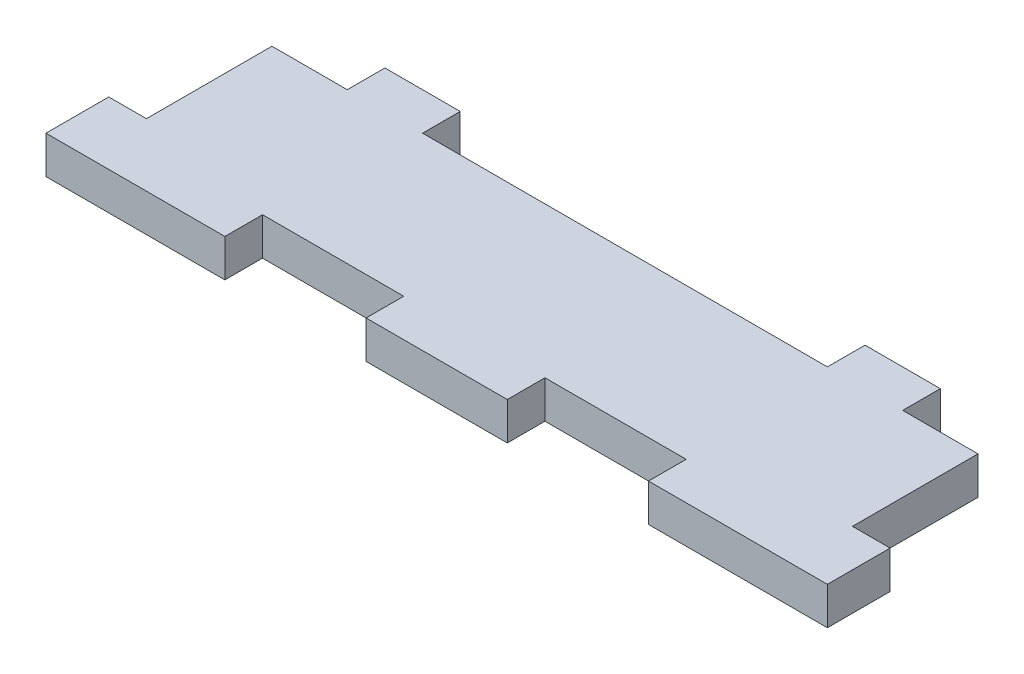
ISO-10303-21;
HEADER;
FILE_DESCRIPTION(('STEP AP214'),'2;1');
FILE_NAME('part.step','',(''),(''),'','','');
FILE_SCHEMA(('AUTOMOTIVE_DESIGN { 1 0 10303 214 1 1 1 1 }'));
ENDSEC;
DATA;
#1=APPLICATION_CONTEXT('core data for automotive mechanical design processes');
#2=APPLICATION_PROTOCOL_DEFINITION('international standard','automotive_design',2000,#1);
#3=PRODUCT_CONTEXT('',#1,'mechanical');
#4=PRODUCT('Part','Part','',(#3));
#5=PRODUCT_RELATED_PRODUCT_CATEGORY('part','',(#4));
#6=PRODUCT_DEFINITION_FORMATION('','',#4);
#7=PRODUCT_DEFINITION_CONTEXT('part definition',#1,'design');
#8=PRODUCT_DEFINITION('design','',#6,#7);
#9=PRODUCT_DEFINITION_SHAPE('','',#8);
#10=(LENGTH_UNIT() NAMED_UNIT(*) SI_UNIT(.MILLI.,.METRE.));
#11=(NAMED_UNIT(*) PLANE_ANGLE_UNIT() SI_UNIT($,.RADIAN.));
#12=(NAMED_UNIT(*) SI_UNIT($,.STERADIAN.) SOLID_ANGLE_UNIT());
#13=UNCERTAINTY_MEASURE_WITH_UNIT(LENGTH_MEASURE(1.E-05),#10,'distance_accuracy_value','');
#14=(GEOMETRIC_REPRESENTATION_CONTEXT(3) GLOBAL_UNCERTAINTY_ASSIGNED_CONTEXT((#13)) GLOBAL_UNIT_ASSIGNED_CONTEXT((#10,
#11,#12)) REPRESENTATION_CONTEXT('',''));
#15=CARTESIAN_POINT('',(0.,0.,0.));
#16=DIRECTION('',(0.,0.,1.));
#17=DIRECTION('',(1.,0.,0.));
#18=AXIS2_PLACEMENT_3D('',#15,#16,#17);
#19=CARTESIAN_POINT('',(-56.25,6.,-12.));
#20=DIRECTION('',(0.,0.,1.));
#21=DIRECTION('',(1.,0.,0.));
#22=AXIS2_PLACEMENT_3D('',#19,#20,#21);
#23=PLANE('',#22);
#24=DIRECTION('',(0.,1.,0.));
#25=VECTOR('',#24,1.);
#26=CARTESIAN_POINT('',(-44.25,0.,-12.));
#27=LINE('',#26,#25);
#28=CARTESIAN_POINT('',(-44.25,0.,-12.));
#29=VERTEX_POINT('',#28);
#30=CARTESIAN_POINT('',(-44.25,6.,-12.));
#31=VERTEX_POINT('',#30);
#32=EDGE_CURVE('E399',#29,#31,#27,.T.);
#33=ORIENTED_EDGE('',*,*,#32,.F.);
#34=DIRECTION('',(-1.,0.,0.));
#35=VECTOR('',#34,1.);
#36=CARTESIAN_POINT('',(-56.25,0.,-12.));
#37=LINE('',#36,#35);
#38=CARTESIAN_POINT('',(-56.25,0.,-12.));
#39=VERTEX_POINT('',#38);
#40=EDGE_CURVE('E226',#29,#39,#37,.T.);
#41=ORIENTED_EDGE('',*,*,#40,.T.);
#42=DIRECTION('',(0.,-1.,0.));
#43=VECTOR('',#42,1.);
#44=CARTESIAN_POINT('',(-56.25,6.,-12.));
#45=LINE('',#44,#43);
#46=CARTESIAN_POINT('',(-56.25,6.,-12.));
#47=VERTEX_POINT('',#46);
#48=EDGE_CURVE('E49',#47,#39,#45,.T.);
#49=ORIENTED_EDGE('',*,*,#48,.F.);
#50=DIRECTION('',(-1.,0.,0.));
#51=VECTOR('',#50,1.);
#52=CARTESIAN_POINT('',(-56.25,6.,-12.));
#53=LINE('',#52,#51);
#54=EDGE_CURVE('E56',#31,#47,#53,.T.);
#55=ORIENTED_EDGE('',*,*,#54,.F.);
#56=EDGE_LOOP('',(#33,#41,#49,#55));
#57=FACE_BOUND('',#56,.T.);
#58=ADVANCED_FACE('F41',(#57),#23,.F.);
#59=CARTESIAN_POINT('',(32.25,0.,-12.));
#60=VERTEX_POINT('',#59);
#61=CARTESIAN_POINT('',(-32.25,0.,-12.));
#62=VERTEX_POINT('',#61);
#63=EDGE_CURVE('E373',#60,#62,#37,.T.);
#64=ORIENTED_EDGE('',*,*,#63,.T.);
#65=DIRECTION('',(0.,1.,0.));
#66=VECTOR('',#65,1.);
#67=CARTESIAN_POINT('',(-32.25,0.,-12.));
#68=LINE('',#67,#66);
#69=CARTESIAN_POINT('',(-32.25,6.,-12.));
#70=VERTEX_POINT('',#69);
#71=EDGE_CURVE('E64',#62,#70,#68,.T.);
#72=ORIENTED_EDGE('',*,*,#71,.T.);
#73=CARTESIAN_POINT('',(32.25,6.,-12.));
#74=VERTEX_POINT('',#73);
#75=EDGE_CURVE('E362',#74,#70,#53,.T.);
#76=ORIENTED_EDGE('',*,*,#75,.F.);
#77=DIRECTION('',(0.,1.,0.));
#78=VECTOR('',#77,1.);
#79=CARTESIAN_POINT('',(32.25,0.,-12.));
#80=LINE('',#79,#78);
#81=EDGE_CURVE('E229',#60,#74,#80,.T.);
#82=ORIENTED_EDGE('',*,*,#81,.F.);
#83=EDGE_LOOP('',(#64,#72,#76,#82));
#84=FACE_BOUND('',#83,.T.);
#85=ADVANCED_FACE('F403',(#84),#23,.F.);
#86=CARTESIAN_POINT('',(56.25,6.,12.));
#87=DIRECTION('',(-1.,0.,0.));
#88=DIRECTION('',(0.,0.,1.));
#89=AXIS2_PLACEMENT_3D('',#86,#87,#88);
#90=PLANE('',#89);
#91=DIRECTION('',(0.,1.,0.));
#92=VECTOR('',#91,1.);
#93=CARTESIAN_POINT('',(56.25,0.,8.));
#94=LINE('',#93,#92);
#95=CARTESIAN_POINT('',(56.25,0.,8.));
#96=VERTEX_POINT('',#95);
#97=CARTESIAN_POINT('',(56.25,6.00000000000007,8.));
#98=VERTEX_POINT('',#97);
#99=EDGE_CURVE('E277',#96,#98,#94,.T.);
#100=ORIENTED_EDGE('',*,*,#99,.F.);
#101=DIRECTION('',(0.,0.,-1.));
#102=VECTOR('',#101,1.);
#103=CARTESIAN_POINT('',(56.25,0.,12.));
#104=LINE('',#103,#102);
#105=CARTESIAN_POINT('',(56.25,0.,-12.));
#106=VERTEX_POINT('',#105);
#107=EDGE_CURVE('E354',#96,#106,#104,.T.);
#108=ORIENTED_EDGE('',*,*,#107,.T.);
#109=DIRECTION('',(0.,-1.,0.));
#110=VECTOR('',#109,1.);
#111=CARTESIAN_POINT('',(56.25,6.,-12.));
#112=LINE('',#111,#110);
#113=CARTESIAN_POINT('',(56.25,6.,-12.));
#114=VERTEX_POINT('',#113);
#115=EDGE_CURVE('E11',#114,#106,#112,.T.);
#116=ORIENTED_EDGE('',*,*,#115,.F.);
#117=DIRECTION('',(0.,0.,-1.));
#118=VECTOR('',#117,1.);
#119=CARTESIAN_POINT('',(56.25,6.,12.));
#120=LINE('',#119,#118);
#121=EDGE_CURVE('E355',#98,#114,#120,.T.);
#122=ORIENTED_EDGE('',*,*,#121,.F.);
#123=EDGE_LOOP('',(#100,#108,#116,#122));
#124=FACE_BOUND('',#123,.T.);
#125=ADVANCED_FACE('F43',(#124),#90,.F.);
#126=CARTESIAN_POINT('',(-56.25,6.,12.));
#127=DIRECTION('',(0.,0.,-1.));
#128=DIRECTION('',(-1.,0.,0.));
#129=AXIS2_PLACEMENT_3D('',#126,#127,#128);
#130=PLANE('',#129);
#131=DIRECTION('',(0.,-1.,0.));
#132=VECTOR('',#131,1.);
#133=CARTESIAN_POINT('',(33.75,0.,12.));
#134=LINE('',#133,#132);
#135=CARTESIAN_POINT('',(33.75,6.,12.));
#136=VERTEX_POINT('',#135);
#137=CARTESIAN_POINT('',(33.75,0.,12.));
#138=VERTEX_POINT('',#137);
#139=EDGE_CURVE('E296',#136,#138,#134,.T.);
#140=ORIENTED_EDGE('',*,*,#139,.F.);
#141=DIRECTION('',(1.,0.,0.));
#142=VECTOR('',#141,1.);
#143=CARTESIAN_POINT('',(-56.25,6.,12.));
#144=LINE('',#143,#142);
#145=CARTESIAN_POINT('',(11.25,6.,12.));
#146=VERTEX_POINT('',#145);
#147=EDGE_CURVE('E365',#146,#136,#144,.T.);
#148=ORIENTED_EDGE('',*,*,#147,.F.);
#149=DIRECTION('',(0.,1.,0.));
#150=VECTOR('',#149,1.);
#151=CARTESIAN_POINT('',(11.25,0.,12.));
#152=LINE('',#151,#150);
#153=CARTESIAN_POINT('',(11.25,0.,12.));
#154=VERTEX_POINT('',#153);
#155=EDGE_CURVE('E317',#154,#146,#152,.T.);
#156=ORIENTED_EDGE('',*,*,#155,.F.);
#157=DIRECTION('',(1.,0.,0.));
#158=VECTOR('',#157,1.);
#159=CARTESIAN_POINT('',(-56.25,0.,12.));
#160=LINE('',#159,#158);
#161=EDGE_CURVE('E376',#154,#138,#160,.T.);
#162=ORIENTED_EDGE('',*,*,#161,.T.);
#163=EDGE_LOOP('',(#140,#148,#156,#162));
#164=FACE_BOUND('',#163,.T.);
#165=ADVANCED_FACE('F443',(#164),#130,.F.);
#166=DIRECTION('',(0.,-1.,0.));
#167=VECTOR('',#166,1.);
#168=CARTESIAN_POINT('',(-11.25,0.,12.));
#169=LINE('',#168,#167);
#170=CARTESIAN_POINT('',(-11.25,6.,12.));
#171=VERTEX_POINT('',#170);
#172=CARTESIAN_POINT('',(-11.25,0.,12.));
#173=VERTEX_POINT('',#172);
#174=EDGE_CURVE('E312',#171,#173,#169,.T.);
#175=ORIENTED_EDGE('',*,*,#174,.F.);
#176=CARTESIAN_POINT('',(-33.75,6.,12.));
#177=VERTEX_POINT('',#176);
#178=EDGE_CURVE('E366',#177,#171,#144,.T.);
#179=ORIENTED_EDGE('',*,*,#178,.F.);
#180=DIRECTION('',(0.,1.,0.));
#181=VECTOR('',#180,1.);
#182=CARTESIAN_POINT('',(-33.75,0.,12.));
#183=LINE('',#182,#181);
#184=CARTESIAN_POINT('',(-33.75,0.,12.));
#185=VERTEX_POINT('',#184);
#186=EDGE_CURVE('E339',#185,#177,#183,.T.);
#187=ORIENTED_EDGE('',*,*,#186,.F.);
#188=EDGE_CURVE('E357',#185,#173,#160,.T.);
#189=ORIENTED_EDGE('',*,*,#188,.T.);
#190=EDGE_LOOP('',(#175,#179,#187,#189));
#191=FACE_BOUND('',#190,.T.);
#192=ADVANCED_FACE('F459',(#191),#130,.F.);
#193=CARTESIAN_POINT('',(44.25,0.,-12.));
#194=VERTEX_POINT('',#193);
#195=EDGE_CURVE('E370',#106,#194,#37,.T.);
#196=ORIENTED_EDGE('',*,*,#195,.T.);
#197=DIRECTION('',(0.,1.,0.));
#198=VECTOR('',#197,1.);
#199=CARTESIAN_POINT('',(44.25,0.,-12.));
#200=LINE('',#199,#198);
#201=CARTESIAN_POINT('',(44.25,6.,-12.));
#202=VERTEX_POINT('',#201);
#203=EDGE_CURVE('E227',#194,#202,#200,.T.);
#204=ORIENTED_EDGE('',*,*,#203,.T.);
#205=EDGE_CURVE('E358',#114,#202,#53,.T.);
#206=ORIENTED_EDGE('',*,*,#205,.F.);
#207=ORIENTED_EDGE('',*,*,#115,.T.);
#208=EDGE_LOOP('',(#196,#204,#206,#207));
#209=FACE_BOUND('',#208,.T.);
#210=ADVANCED_FACE('F419',(#209),#23,.F.);
#211=CARTESIAN_POINT('',(-56.25,6.,12.));
#212=DIRECTION('',(1.,0.,0.));
#213=DIRECTION('',(0.,0.,-1.));
#214=AXIS2_PLACEMENT_3D('',#211,#212,#213);
#215=PLANE('',#214);
#216=DIRECTION('',(0.,0.,1.));
#217=VECTOR('',#216,1.);
#218=CARTESIAN_POINT('',(-56.25,0.,12.));
#219=LINE('',#218,#217);
#220=CARTESIAN_POINT('',(-56.25,0.,8.));
#221=VERTEX_POINT('',#220);
#222=EDGE_CURVE('E372',#39,#221,#219,.T.);
#223=ORIENTED_EDGE('',*,*,#222,.T.);
#224=DIRECTION('',(0.,1.,0.));
#225=VECTOR('',#224,1.);
#226=CARTESIAN_POINT('',(-56.25,0.,8.));
#227=LINE('',#226,#225);
#228=CARTESIAN_POINT('',(-56.25,6.,8.));
#229=VERTEX_POINT('',#228);
#230=EDGE_CURVE('E258',#221,#229,#227,.T.);
#231=ORIENTED_EDGE('',*,*,#230,.T.);
#232=DIRECTION('',(0.,0.,1.));
#233=VECTOR('',#232,1.);
#234=CARTESIAN_POINT('',(-56.25,6.,12.));
#235=LINE('',#234,#233);
#236=EDGE_CURVE('E361',#47,#229,#235,.T.);
#237=ORIENTED_EDGE('',*,*,#236,.F.);
#238=ORIENTED_EDGE('',*,*,#48,.T.);
#239=EDGE_LOOP('',(#223,#231,#237,#238));
#240=FACE_BOUND('',#239,.T.);
#241=ADVANCED_FACE('F380',(#240),#215,.F.);
#242=CARTESIAN_POINT('',(0.,6.,0.));
#243=DIRECTION('',(0.,-1.,0.));
#244=DIRECTION('',(0.,0.,-1.));
#245=AXIS2_PLACEMENT_3D('',#242,#243,#244);
#246=PLANE('',#245);
#247=DIRECTION('',(-1.,0.,0.));
#248=VECTOR('',#247,1.);
#249=CARTESIAN_POINT('',(33.75,6.,18.));
#250=LINE('',#249,#248);
#251=CARTESIAN_POINT('',(62.25,6.00000000000007,18.));
#252=VERTEX_POINT('',#251);
#253=CARTESIAN_POINT('',(33.75,6.,18.));
#254=VERTEX_POINT('',#253);
#255=EDGE_CURVE('E302',#252,#254,#250,.T.);
#256=ORIENTED_EDGE('',*,*,#255,.F.);
#257=DIRECTION('',(0.,0.,1.));
#258=VECTOR('',#257,1.);
#259=CARTESIAN_POINT('',(62.25,6.00000000000007,18.));
#260=LINE('',#259,#258);
#261=CARTESIAN_POINT('',(62.25,6.00000000000007,8.));
#262=VERTEX_POINT('',#261);
#263=EDGE_CURVE('E285',#262,#252,#260,.T.);
#264=ORIENTED_EDGE('',*,*,#263,.F.);
#265=DIRECTION('',(-1.,0.,0.));
#266=VECTOR('',#265,1.);
#267=CARTESIAN_POINT('',(62.25,6.00000000000007,8.));
#268=LINE('',#267,#266);
#269=EDGE_CURVE('E288',#262,#98,#268,.T.);
#270=ORIENTED_EDGE('',*,*,#269,.T.);
#271=ORIENTED_EDGE('',*,*,#121,.T.);
#272=ORIENTED_EDGE('',*,*,#205,.T.);
#273=DIRECTION('',(0.,0.,1.));
#274=VECTOR('',#273,1.);
#275=CARTESIAN_POINT('',(44.25,6.,-18.));
#276=LINE('',#275,#274);
#277=CARTESIAN_POINT('',(44.25,6.,-18.));
#278=VERTEX_POINT('',#277);
#279=EDGE_CURVE('E243',#278,#202,#276,.T.);
#280=ORIENTED_EDGE('',*,*,#279,.F.);
#281=DIRECTION('',(1.,0.,0.));
#282=VECTOR('',#281,1.);
#283=CARTESIAN_POINT('',(0.,6.,-18.));
#284=LINE('',#283,#282);
#285=CARTESIAN_POINT('',(32.25,6.,-18.));
#286=VERTEX_POINT('',#285);
#287=EDGE_CURVE('E242',#286,#278,#284,.T.);
#288=ORIENTED_EDGE('',*,*,#287,.F.);
#289=DIRECTION('',(0.,0.,1.));
#290=VECTOR('',#289,1.);
#291=CARTESIAN_POINT('',(32.25,6.,-18.));
#292=LINE('',#291,#290);
#293=EDGE_CURVE('E249',#286,#74,#292,.T.);
#294=ORIENTED_EDGE('',*,*,#293,.T.);
#295=ORIENTED_EDGE('',*,*,#75,.T.);
#296=DIRECTION('',(0.,0.,1.));
#297=VECTOR('',#296,1.);
#298=CARTESIAN_POINT('',(-32.25,6.,-18.));
#299=LINE('',#298,#297);
#300=CARTESIAN_POINT('',(-32.25,6.,-18.));
#301=VERTEX_POINT('',#300);
#302=EDGE_CURVE('E231',#301,#70,#299,.T.);
#303=ORIENTED_EDGE('',*,*,#302,.F.);
#304=DIRECTION('',(1.,0.,0.));
#305=VECTOR('',#304,1.);
#306=CARTESIAN_POINT('',(0.,6.,-18.));
#307=LINE('',#306,#305);
#308=CARTESIAN_POINT('',(-44.25,6.,-18.));
#309=VERTEX_POINT('',#308);
#310=EDGE_CURVE('E212',#309,#301,#307,.T.);
#311=ORIENTED_EDGE('',*,*,#310,.F.);
#312=DIRECTION('',(0.,0.,1.));
#313=VECTOR('',#312,1.);
#314=CARTESIAN_POINT('',(-44.25,6.,-18.));
#315=LINE('',#314,#313);
#316=EDGE_CURVE('E209',#309,#31,#315,.T.);
#317=ORIENTED_EDGE('',*,*,#316,.T.);
#318=ORIENTED_EDGE('',*,*,#54,.T.);
#319=ORIENTED_EDGE('',*,*,#236,.T.);
#320=DIRECTION('',(1.,0.,0.));
#321=VECTOR('',#320,1.);
#322=CARTESIAN_POINT('',(-62.25,6.00000000000007,8.));
#323=LINE('',#322,#321);
#324=CARTESIAN_POINT('',(-62.25,6.00000000000007,8.));
#325=VERTEX_POINT('',#324);
#326=EDGE_CURVE('E275',#325,#229,#323,.T.);
#327=ORIENTED_EDGE('',*,*,#326,.F.);
#328=DIRECTION('',(0.,0.,1.));
#329=VECTOR('',#328,1.);
#330=CARTESIAN_POINT('',(-62.25,6.00000000000007,18.));
#331=LINE('',#330,#329);
#332=CARTESIAN_POINT('',(-62.25,6.00000000000007,18.));
#333=VERTEX_POINT('',#332);
#334=EDGE_CURVE('E262',#325,#333,#331,.T.);
#335=ORIENTED_EDGE('',*,*,#334,.T.);
#336=DIRECTION('',(-1.,0.,0.));
#337=VECTOR('',#336,1.);
#338=CARTESIAN_POINT('',(-56.25,6.,18.));
#339=LINE('',#338,#337);
#340=CARTESIAN_POINT('',(-33.75,6.,18.));
#341=VERTEX_POINT('',#340);
#342=EDGE_CURVE('E344',#341,#333,#339,.T.);
#343=ORIENTED_EDGE('',*,*,#342,.F.);
#344=DIRECTION('',(0.,0.,-1.));
#345=VECTOR('',#344,1.);
#346=CARTESIAN_POINT('',(-33.75,6.,18.));
#347=LINE('',#346,#345);
#348=EDGE_CURVE('E346',#341,#177,#347,.T.);
#349=ORIENTED_EDGE('',*,*,#348,.T.);
#350=ORIENTED_EDGE('',*,*,#178,.T.);
#351=DIRECTION('',(0.,0.,-1.));
#352=VECTOR('',#351,1.);
#353=CARTESIAN_POINT('',(-11.25,6.,18.));
#354=LINE('',#353,#352);
#355=CARTESIAN_POINT('',(-11.25,6.,18.));
#356=VERTEX_POINT('',#355);
#357=EDGE_CURVE('E323',#356,#171,#354,.T.);
#358=ORIENTED_EDGE('',*,*,#357,.F.);
#359=DIRECTION('',(-1.,0.,0.));
#360=VECTOR('',#359,1.);
#361=CARTESIAN_POINT('',(-11.25,6.,18.));
#362=LINE('',#361,#360);
#363=CARTESIAN_POINT('',(11.25,6.,18.));
#364=VERTEX_POINT('',#363);
#365=EDGE_CURVE('E321',#364,#356,#362,.T.);
#366=ORIENTED_EDGE('',*,*,#365,.F.);
#367=DIRECTION('',(0.,0.,-1.));
#368=VECTOR('',#367,1.);
#369=CARTESIAN_POINT('',(11.25,6.,18.));
#370=LINE('',#369,#368);
#371=EDGE_CURVE('E330',#364,#146,#370,.T.);
#372=ORIENTED_EDGE('',*,*,#371,.T.);
#373=ORIENTED_EDGE('',*,*,#147,.T.);
#374=DIRECTION('',(0.,0.,-1.));
#375=VECTOR('',#374,1.);
#376=CARTESIAN_POINT('',(33.75,6.,18.));
#377=LINE('',#376,#375);
#378=EDGE_CURVE('E304',#254,#136,#377,.T.);
#379=ORIENTED_EDGE('',*,*,#378,.F.);
#380=EDGE_LOOP('',(#256,#264,#270,#271,#272,#280,#288,#294,#295,#303,#311,#317,#318,#319,#327,
#335,#343,#349,#350,#358,#366,#372,#373,#379));
#381=FACE_BOUND('',#380,.T.);
#382=ADVANCED_FACE('F387',(#381),#246,.F.);
#383=CARTESIAN_POINT('',(0.,0.,0.));
#384=DIRECTION('',(0.,-1.,0.));
#385=DIRECTION('',(0.,0.,-1.));
#386=AXIS2_PLACEMENT_3D('',#383,#384,#385);
#387=PLANE('',#386);
#388=ORIENTED_EDGE('',*,*,#107,.F.);
#389=DIRECTION('',(-1.,0.,0.));
#390=VECTOR('',#389,1.);
#391=CARTESIAN_POINT('',(62.25,0.,8.));
#392=LINE('',#391,#390);
#393=CARTESIAN_POINT('',(62.25,0.,8.));
#394=VERTEX_POINT('',#393);
#395=EDGE_CURVE('E293',#394,#96,#392,.T.);
#396=ORIENTED_EDGE('',*,*,#395,.F.);
#397=DIRECTION('',(0.,0.,-1.));
#398=VECTOR('',#397,1.);
#399=CARTESIAN_POINT('',(62.25,0.,18.));
#400=LINE('',#399,#398);
#401=CARTESIAN_POINT('',(62.25,0.,18.));
#402=VERTEX_POINT('',#401);
#403=EDGE_CURVE('E281',#402,#394,#400,.T.);
#404=ORIENTED_EDGE('',*,*,#403,.F.);
#405=DIRECTION('',(1.,0.,0.));
#406=VECTOR('',#405,1.);
#407=CARTESIAN_POINT('',(33.75,0.,18.));
#408=LINE('',#407,#406);
#409=CARTESIAN_POINT('',(33.75,0.,18.));
#410=VERTEX_POINT('',#409);
#411=EDGE_CURVE('E300',#410,#402,#408,.T.);
#412=ORIENTED_EDGE('',*,*,#411,.F.);
#413=DIRECTION('',(0.,0.,-1.));
#414=VECTOR('',#413,1.);
#415=CARTESIAN_POINT('',(33.75,0.,18.));
#416=LINE('',#415,#414);
#417=EDGE_CURVE('E309',#410,#138,#416,.T.);
#418=ORIENTED_EDGE('',*,*,#417,.T.);
#419=ORIENTED_EDGE('',*,*,#161,.F.);
#420=DIRECTION('',(0.,0.,-1.));
#421=VECTOR('',#420,1.);
#422=CARTESIAN_POINT('',(11.25,0.,18.));
#423=LINE('',#422,#421);
#424=CARTESIAN_POINT('',(11.25,0.,18.));
#425=VERTEX_POINT('',#424);
#426=EDGE_CURVE('E333',#425,#154,#423,.T.);
#427=ORIENTED_EDGE('',*,*,#426,.F.);
#428=DIRECTION('',(1.,0.,0.));
#429=VECTOR('',#428,1.);
#430=CARTESIAN_POINT('',(-11.25,0.,18.));
#431=LINE('',#430,#429);
#432=CARTESIAN_POINT('',(-11.25,0.,18.));
#433=VERTEX_POINT('',#432);
#434=EDGE_CURVE('E316',#433,#425,#431,.T.);
#435=ORIENTED_EDGE('',*,*,#434,.F.);
#436=DIRECTION('',(0.,0.,-1.));
#437=VECTOR('',#436,1.);
#438=CARTESIAN_POINT('',(-11.25,0.,18.));
#439=LINE('',#438,#437);
#440=EDGE_CURVE('E336',#433,#173,#439,.T.);
#441=ORIENTED_EDGE('',*,*,#440,.T.);
#442=ORIENTED_EDGE('',*,*,#188,.F.);
#443=DIRECTION('',(0.,0.,-1.));
#444=VECTOR('',#443,1.);
#445=CARTESIAN_POINT('',(-33.75,0.,18.));
#446=LINE('',#445,#444);
#447=CARTESIAN_POINT('',(-33.75,0.,18.));
#448=VERTEX_POINT('',#447);
#449=EDGE_CURVE('E351',#448,#185,#446,.T.);
#450=ORIENTED_EDGE('',*,*,#449,.F.);
#451=DIRECTION('',(1.,0.,0.));
#452=VECTOR('',#451,1.);
#453=CARTESIAN_POINT('',(-56.25,0.,18.));
#454=LINE('',#453,#452);
#455=CARTESIAN_POINT('',(-62.25,0.,18.));
#456=VERTEX_POINT('',#455);
#457=EDGE_CURVE('E340',#456,#448,#454,.T.);
#458=ORIENTED_EDGE('',*,*,#457,.F.);
#459=DIRECTION('',(0.,0.,-1.));
#460=VECTOR('',#459,1.);
#461=CARTESIAN_POINT('',(-62.25,0.,18.));
#462=LINE('',#461,#460);
#463=CARTESIAN_POINT('',(-62.25,0.,8.));
#464=VERTEX_POINT('',#463);
#465=EDGE_CURVE('E268',#456,#464,#462,.T.);
#466=ORIENTED_EDGE('',*,*,#465,.T.);
#467=DIRECTION('',(1.,0.,0.));
#468=VECTOR('',#467,1.);
#469=CARTESIAN_POINT('',(-62.25,0.,8.));
#470=LINE('',#469,#468);
#471=EDGE_CURVE('E271',#464,#221,#470,.T.);
#472=ORIENTED_EDGE('',*,*,#471,.T.);
#473=ORIENTED_EDGE('',*,*,#222,.F.);
#474=ORIENTED_EDGE('',*,*,#40,.F.);
#475=DIRECTION('',(0.,0.,1.));
#476=VECTOR('',#475,1.);
#477=CARTESIAN_POINT('',(-44.25,0.,-18.));
#478=LINE('',#477,#476);
#479=CARTESIAN_POINT('',(-44.25,0.,-18.));
#480=VERTEX_POINT('',#479);
#481=EDGE_CURVE('E207',#480,#29,#478,.T.);
#482=ORIENTED_EDGE('',*,*,#481,.F.);
#483=DIRECTION('',(-1.,0.,0.));
#484=VECTOR('',#483,1.);
#485=CARTESIAN_POINT('',(0.,0.,-18.));
#486=LINE('',#485,#484);
#487=CARTESIAN_POINT('',(-32.25,0.,-18.));
#488=VERTEX_POINT('',#487);
#489=EDGE_CURVE('E213',#488,#480,#486,.T.);
#490=ORIENTED_EDGE('',*,*,#489,.F.);
#491=DIRECTION('',(0.,0.,1.));
#492=VECTOR('',#491,1.);
#493=CARTESIAN_POINT('',(-32.25,0.,-18.));
#494=LINE('',#493,#492);
#495=EDGE_CURVE('E395',#488,#62,#494,.T.);
#496=ORIENTED_EDGE('',*,*,#495,.T.);
#497=ORIENTED_EDGE('',*,*,#63,.F.);
#498=DIRECTION('',(0.,0.,1.));
#499=VECTOR('',#498,1.);
#500=CARTESIAN_POINT('',(32.25,0.,-18.));
#501=LINE('',#500,#499);
#502=CARTESIAN_POINT('',(32.25,0.,-18.));
#503=VERTEX_POINT('',#502);
#504=EDGE_CURVE('E252',#503,#60,#501,.T.);
#505=ORIENTED_EDGE('',*,*,#504,.F.);
#506=DIRECTION('',(-1.,0.,0.));
#507=VECTOR('',#506,1.);
#508=CARTESIAN_POINT('',(0.,0.,-18.));
#509=LINE('',#508,#507);
#510=CARTESIAN_POINT('',(44.25,0.,-18.));
#511=VERTEX_POINT('',#510);
#512=EDGE_CURVE('E238',#511,#503,#509,.T.);
#513=ORIENTED_EDGE('',*,*,#512,.F.);
#514=DIRECTION('',(0.,0.,1.));
#515=VECTOR('',#514,1.);
#516=CARTESIAN_POINT('',(44.25,0.,-18.));
#517=LINE('',#516,#515);
#518=EDGE_CURVE('E255',#511,#194,#517,.T.);
#519=ORIENTED_EDGE('',*,*,#518,.T.);
#520=ORIENTED_EDGE('',*,*,#195,.F.);
#521=EDGE_LOOP('',(#388,#396,#404,#412,#418,#419,#427,#435,#441,#442,#450,#458,#466,#472,#473,
#474,#482,#490,#496,#497,#505,#513,#519,#520));
#522=FACE_BOUND('',#521,.T.);
#523=ADVANCED_FACE('F224',(#522),#387,.T.);
#524=CARTESIAN_POINT('',(-33.75,0.,18.));
#525=DIRECTION('',(-1.,0.,0.));
#526=DIRECTION('',(0.,0.,1.));
#527=AXIS2_PLACEMENT_3D('',#524,#525,#526);
#528=PLANE('',#527);
#529=ORIENTED_EDGE('',*,*,#186,.T.);
#530=ORIENTED_EDGE('',*,*,#348,.F.);
#531=DIRECTION('',(0.,1.,0.));
#532=VECTOR('',#531,1.);
#533=CARTESIAN_POINT('',(-33.75,0.,18.));
#534=LINE('',#533,#532);
#535=EDGE_CURVE('E342',#448,#341,#534,.T.);
#536=ORIENTED_EDGE('',*,*,#535,.F.);
#537=ORIENTED_EDGE('',*,*,#449,.T.);
#538=EDGE_LOOP('',(#529,#530,#536,#537));
#539=FACE_BOUND('',#538,.T.);
#540=ADVANCED_FACE('F464',(#539),#528,.F.);
#541=CARTESIAN_POINT('',(0.,0.,18.));
#542=DIRECTION('',(0.,0.,-1.));
#543=DIRECTION('',(-1.,0.,0.));
#544=AXIS2_PLACEMENT_3D('',#541,#542,#543);
#545=PLANE('',#544);
#546=ORIENTED_EDGE('',*,*,#342,.T.);
#547=DIRECTION('',(0.,-1.,0.));
#548=VECTOR('',#547,1.);
#549=CARTESIAN_POINT('',(-62.25,0.,18.));
#550=LINE('',#549,#548);
#551=EDGE_CURVE('E259',#333,#456,#550,.T.);
#552=ORIENTED_EDGE('',*,*,#551,.T.);
#553=ORIENTED_EDGE('',*,*,#457,.T.);
#554=ORIENTED_EDGE('',*,*,#535,.T.);
#555=EDGE_LOOP('',(#546,#552,#553,#554));
#556=FACE_BOUND('',#555,.T.);
#557=ADVANCED_FACE('F467',(#556),#545,.F.);
#558=CARTESIAN_POINT('',(-11.25,0.,18.));
#559=DIRECTION('',(1.,0.,0.));
#560=DIRECTION('',(0.,0.,-1.));
#561=AXIS2_PLACEMENT_3D('',#558,#559,#560);
#562=PLANE('',#561);
#563=ORIENTED_EDGE('',*,*,#174,.T.);
#564=ORIENTED_EDGE('',*,*,#440,.F.);
#565=DIRECTION('',(0.,-1.,0.));
#566=VECTOR('',#565,1.);
#567=CARTESIAN_POINT('',(-11.25,0.,18.));
#568=LINE('',#567,#566);
#569=EDGE_CURVE('E313',#356,#433,#568,.T.);
#570=ORIENTED_EDGE('',*,*,#569,.F.);
#571=ORIENTED_EDGE('',*,*,#357,.T.);
#572=EDGE_LOOP('',(#563,#564,#570,#571));
#573=FACE_BOUND('',#572,.T.);
#574=ADVANCED_FACE('F457',(#573),#562,.F.);
#575=CARTESIAN_POINT('',(11.25,0.,18.));
#576=DIRECTION('',(-1.,0.,0.));
#577=DIRECTION('',(0.,0.,1.));
#578=AXIS2_PLACEMENT_3D('',#575,#576,#577);
#579=PLANE('',#578);
#580=ORIENTED_EDGE('',*,*,#155,.T.);
#581=ORIENTED_EDGE('',*,*,#371,.F.);
#582=DIRECTION('',(0.,1.,0.));
#583=VECTOR('',#582,1.);
#584=CARTESIAN_POINT('',(11.25,0.,18.));
#585=LINE('',#584,#583);
#586=EDGE_CURVE('E319',#425,#364,#585,.T.);
#587=ORIENTED_EDGE('',*,*,#586,.F.);
#588=ORIENTED_EDGE('',*,*,#426,.T.);
#589=EDGE_LOOP('',(#580,#581,#587,#588));
#590=FACE_BOUND('',#589,.T.);
#591=ADVANCED_FACE('F447',(#590),#579,.F.);
#592=CARTESIAN_POINT('',(0.,0.,18.));
#593=DIRECTION('',(0.,0.,-1.));
#594=DIRECTION('',(-1.,0.,0.));
#595=AXIS2_PLACEMENT_3D('',#592,#593,#594);
#596=PLANE('',#595);
#597=ORIENTED_EDGE('',*,*,#569,.T.);
#598=ORIENTED_EDGE('',*,*,#434,.T.);
#599=ORIENTED_EDGE('',*,*,#586,.T.);
#600=ORIENTED_EDGE('',*,*,#365,.T.);
#601=EDGE_LOOP('',(#597,#598,#599,#600));
#602=FACE_BOUND('',#601,.T.);
#603=ADVANCED_FACE('F450',(#602),#596,.F.);
#604=CARTESIAN_POINT('',(33.75,0.,18.));
#605=DIRECTION('',(1.,0.,0.));
#606=DIRECTION('',(0.,0.,-1.));
#607=AXIS2_PLACEMENT_3D('',#604,#605,#606);
#608=PLANE('',#607);
#609=ORIENTED_EDGE('',*,*,#139,.T.);
#610=ORIENTED_EDGE('',*,*,#417,.F.);
#611=DIRECTION('',(0.,-1.,0.));
#612=VECTOR('',#611,1.);
#613=CARTESIAN_POINT('',(33.75,0.,18.));
#614=LINE('',#613,#612);
#615=EDGE_CURVE('E297',#254,#410,#614,.T.);
#616=ORIENTED_EDGE('',*,*,#615,.F.);
#617=ORIENTED_EDGE('',*,*,#378,.T.);
#618=EDGE_LOOP('',(#609,#610,#616,#617));
#619=FACE_BOUND('',#618,.T.);
#620=ADVANCED_FACE('F438',(#619),#608,.F.);
#621=CARTESIAN_POINT('',(0.,0.,18.));
#622=DIRECTION('',(0.,0.,-1.));
#623=DIRECTION('',(-1.,0.,0.));
#624=AXIS2_PLACEMENT_3D('',#621,#622,#623);
#625=PLANE('',#624);
#626=ORIENTED_EDGE('',*,*,#615,.T.);
#627=ORIENTED_EDGE('',*,*,#411,.T.);
#628=DIRECTION('',(0.,-1.,0.));
#629=VECTOR('',#628,1.);
#630=CARTESIAN_POINT('',(62.25,0.,18.));
#631=LINE('',#630,#629);
#632=EDGE_CURVE('E278',#252,#402,#631,.T.);
#633=ORIENTED_EDGE('',*,*,#632,.F.);
#634=ORIENTED_EDGE('',*,*,#255,.T.);
#635=EDGE_LOOP('',(#626,#627,#633,#634));
#636=FACE_BOUND('',#635,.T.);
#637=ADVANCED_FACE('F433',(#636),#625,.F.);
#638=CARTESIAN_POINT('',(62.25,0.,8.));
#639=DIRECTION('',(0.,0.,1.));
#640=DIRECTION('',(1.,0.,0.));
#641=AXIS2_PLACEMENT_3D('',#638,#639,#640);
#642=PLANE('',#641);
#643=ORIENTED_EDGE('',*,*,#99,.T.);
#644=ORIENTED_EDGE('',*,*,#269,.F.);
#645=DIRECTION('',(0.,1.,0.));
#646=VECTOR('',#645,1.);
#647=CARTESIAN_POINT('',(62.25,0.,8.));
#648=LINE('',#647,#646);
#649=EDGE_CURVE('E283',#394,#262,#648,.T.);
#650=ORIENTED_EDGE('',*,*,#649,.F.);
#651=ORIENTED_EDGE('',*,*,#395,.T.);
#652=EDGE_LOOP('',(#643,#644,#650,#651));
#653=FACE_BOUND('',#652,.T.);
#654=ADVANCED_FACE('F425',(#653),#642,.F.);
#655=CARTESIAN_POINT('',(62.25,0.,0.));
#656=DIRECTION('',(-1.,0.,0.));
#657=DIRECTION('',(0.,0.,1.));
#658=AXIS2_PLACEMENT_3D('',#655,#656,#657);
#659=PLANE('',#658);
#660=ORIENTED_EDGE('',*,*,#632,.T.);
#661=ORIENTED_EDGE('',*,*,#403,.T.);
#662=ORIENTED_EDGE('',*,*,#649,.T.);
#663=ORIENTED_EDGE('',*,*,#263,.T.);
#664=EDGE_LOOP('',(#660,#661,#662,#663));
#665=FACE_BOUND('',#664,.T.);
#666=ADVANCED_FACE('F431',(#665),#659,.F.);
#667=CARTESIAN_POINT('',(-62.25,0.,8.));
#668=DIRECTION('',(0.,0.,-1.));
#669=DIRECTION('',(-1.,0.,0.));
#670=AXIS2_PLACEMENT_3D('',#667,#668,#669);
#671=PLANE('',#670);
#672=ORIENTED_EDGE('',*,*,#230,.F.);
#673=ORIENTED_EDGE('',*,*,#471,.F.);
#674=DIRECTION('',(0.,1.,0.));
#675=VECTOR('',#674,1.);
#676=CARTESIAN_POINT('',(-62.25,0.,8.));
#677=LINE('',#676,#675);
#678=EDGE_CURVE('E265',#464,#325,#677,.T.);
#679=ORIENTED_EDGE('',*,*,#678,.T.);
#680=ORIENTED_EDGE('',*,*,#326,.T.);
#681=EDGE_LOOP('',(#672,#673,#679,#680));
#682=FACE_BOUND('',#681,.T.);
#683=ADVANCED_FACE('F385',(#682),#671,.T.);
#684=CARTESIAN_POINT('',(-62.25,0.,0.));
#685=DIRECTION('',(1.,0.,0.));
#686=DIRECTION('',(0.,0.,1.));
#687=AXIS2_PLACEMENT_3D('',#684,#685,#686);
#688=PLANE('',#687);
#689=ORIENTED_EDGE('',*,*,#551,.F.);
#690=ORIENTED_EDGE('',*,*,#334,.F.);
#691=ORIENTED_EDGE('',*,*,#678,.F.);
#692=ORIENTED_EDGE('',*,*,#465,.F.);
#693=EDGE_LOOP('',(#689,#690,#691,#692));
#694=FACE_BOUND('',#693,.T.);
#695=ADVANCED_FACE('F469',(#694),#688,.F.);
#696=CARTESIAN_POINT('',(44.25,0.,-18.));
#697=DIRECTION('',(1.,0.,0.));
#698=DIRECTION('',(0.,0.,-1.));
#699=AXIS2_PLACEMENT_3D('',#696,#697,#698);
#700=PLANE('',#699);
#701=ORIENTED_EDGE('',*,*,#203,.F.);
#702=ORIENTED_EDGE('',*,*,#518,.F.);
#703=DIRECTION('',(0.,1.,0.));
#704=VECTOR('',#703,1.);
#705=CARTESIAN_POINT('',(44.25,0.,-18.));
#706=LINE('',#705,#704);
#707=EDGE_CURVE('E235',#511,#278,#706,.T.);
#708=ORIENTED_EDGE('',*,*,#707,.T.);
#709=ORIENTED_EDGE('',*,*,#279,.T.);
#710=EDGE_LOOP('',(#701,#702,#708,#709));
#711=FACE_BOUND('',#710,.T.);
#712=ADVANCED_FACE('F416',(#711),#700,.T.);
#713=CARTESIAN_POINT('',(32.25,0.,-18.));
#714=DIRECTION('',(1.,0.,0.));
#715=DIRECTION('',(0.,0.,-1.));
#716=AXIS2_PLACEMENT_3D('',#713,#714,#715);
#717=PLANE('',#716);
#718=ORIENTED_EDGE('',*,*,#81,.T.);
#719=ORIENTED_EDGE('',*,*,#293,.F.);
#720=DIRECTION('',(0.,1.,0.));
#721=VECTOR('',#720,1.);
#722=CARTESIAN_POINT('',(32.25,0.,-18.));
#723=LINE('',#722,#721);
#724=EDGE_CURVE('E240',#503,#286,#723,.T.);
#725=ORIENTED_EDGE('',*,*,#724,.F.);
#726=ORIENTED_EDGE('',*,*,#504,.T.);
#727=EDGE_LOOP('',(#718,#719,#725,#726));
#728=FACE_BOUND('',#727,.T.);
#729=ADVANCED_FACE('F408',(#728),#717,.F.);
#730=CARTESIAN_POINT('',(0.,0.,-18.));
#731=DIRECTION('',(0.,0.,-1.));
#732=DIRECTION('',(-1.,0.,0.));
#733=AXIS2_PLACEMENT_3D('',#730,#731,#732);
#734=PLANE('',#733);
#735=ORIENTED_EDGE('',*,*,#707,.F.);
#736=ORIENTED_EDGE('',*,*,#512,.T.);
#737=ORIENTED_EDGE('',*,*,#724,.T.);
#738=ORIENTED_EDGE('',*,*,#287,.T.);
#739=EDGE_LOOP('',(#735,#736,#737,#738));
#740=FACE_BOUND('',#739,.T.);
#741=ADVANCED_FACE('F411',(#740),#734,.T.);
#742=CARTESIAN_POINT('',(-44.25,0.,-18.));
#743=DIRECTION('',(1.,0.,0.));
#744=DIRECTION('',(0.,0.,-1.));
#745=AXIS2_PLACEMENT_3D('',#742,#743,#744);
#746=PLANE('',#745);
#747=ORIENTED_EDGE('',*,*,#32,.T.);
#748=ORIENTED_EDGE('',*,*,#316,.F.);
#749=DIRECTION('',(0.,1.,0.));
#750=VECTOR('',#749,1.);
#751=CARTESIAN_POINT('',(-44.25,0.,-18.));
#752=LINE('',#751,#750);
#753=EDGE_CURVE('E203',#480,#309,#752,.T.);
#754=ORIENTED_EDGE('',*,*,#753,.F.);
#755=ORIENTED_EDGE('',*,*,#481,.T.);
#756=EDGE_LOOP('',(#747,#748,#754,#755));
#757=FACE_BOUND('',#756,.T.);
#758=ADVANCED_FACE('F205',(#757),#746,.F.);
#759=CARTESIAN_POINT('',(-32.25,0.,-18.));
#760=DIRECTION('',(1.,0.,0.));
#761=DIRECTION('',(0.,0.,-1.));
#762=AXIS2_PLACEMENT_3D('',#759,#760,#761);
#763=PLANE('',#762);
#764=ORIENTED_EDGE('',*,*,#71,.F.);
#765=ORIENTED_EDGE('',*,*,#495,.F.);
#766=DIRECTION('',(0.,1.,0.));
#767=VECTOR('',#766,1.);
#768=CARTESIAN_POINT('',(-32.25,0.,-18.));
#769=LINE('',#768,#767);
#770=EDGE_CURVE('E219',#488,#301,#769,.T.);
#771=ORIENTED_EDGE('',*,*,#770,.T.);
#772=ORIENTED_EDGE('',*,*,#302,.T.);
#773=EDGE_LOOP('',(#764,#765,#771,#772));
#774=FACE_BOUND('',#773,.T.);
#775=ADVANCED_FACE('F394',(#774),#763,.T.);
#776=CARTESIAN_POINT('',(0.,0.,-18.));
#777=DIRECTION('',(0.,0.,-1.));
#778=DIRECTION('',(-1.,0.,0.));
#779=AXIS2_PLACEMENT_3D('',#776,#777,#778);
#780=PLANE('',#779);
#781=ORIENTED_EDGE('',*,*,#489,.T.);
#782=ORIENTED_EDGE('',*,*,#753,.T.);
#783=ORIENTED_EDGE('',*,*,#310,.T.);
#784=ORIENTED_EDGE('',*,*,#770,.F.);
#785=EDGE_LOOP('',(#781,#782,#783,#784));
#786=FACE_BOUND('',#785,.T.);
#787=ADVANCED_FACE('F217',(#786),#780,.T.);
#788=CLOSED_SHELL('',(#58,#85,#125,#165,#192,#210,#241,#382,#523,#540,#557,#574,#591,#603,#620,
#637,#654,#666,#683,#695,#712,#729,#741,#758,#775,#787));
#789=MANIFOLD_SOLID_BREP('B2',#788);
#790=ADVANCED_BREP_SHAPE_REPRESENTATION('',(#18,#789),#14);
#791=SHAPE_DEFINITION_REPRESENTATION(#9,#790);
ENDSEC;
END-ISO-10303-21;
